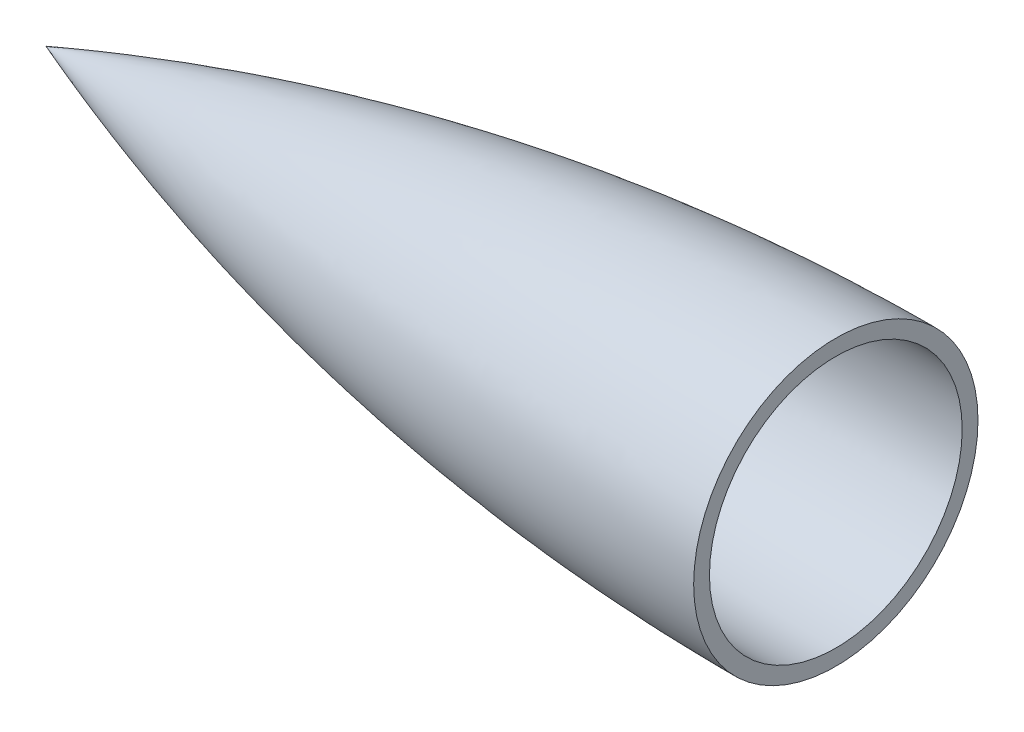
ISO-10303-21;
HEADER;
FILE_DESCRIPTION(('STEP AP214'),'2;1');
FILE_NAME('part.step','',(''),(''),'','','');
FILE_SCHEMA(('AUTOMOTIVE_DESIGN { 1 0 10303 214 1 1 1 1 }'));
ENDSEC;
DATA;
#1=APPLICATION_CONTEXT('core data for automotive mechanical design processes');
#2=APPLICATION_PROTOCOL_DEFINITION('international standard','automotive_design',2000,#1);
#3=PRODUCT_CONTEXT('',#1,'mechanical');
#4=PRODUCT('Part','Part','',(#3));
#5=PRODUCT_RELATED_PRODUCT_CATEGORY('part','',(#4));
#6=PRODUCT_DEFINITION_FORMATION('','',#4);
#7=PRODUCT_DEFINITION_CONTEXT('part definition',#1,'design');
#8=PRODUCT_DEFINITION('design','',#6,#7);
#9=PRODUCT_DEFINITION_SHAPE('','',#8);
#10=(LENGTH_UNIT() NAMED_UNIT(*) SI_UNIT(.MILLI.,.METRE.));
#11=(NAMED_UNIT(*) PLANE_ANGLE_UNIT() SI_UNIT($,.RADIAN.));
#12=(NAMED_UNIT(*) SI_UNIT($,.STERADIAN.) SOLID_ANGLE_UNIT());
#13=UNCERTAINTY_MEASURE_WITH_UNIT(LENGTH_MEASURE(1.E-05),#10,'distance_accuracy_value','');
#14=(GEOMETRIC_REPRESENTATION_CONTEXT(3) GLOBAL_UNCERTAINTY_ASSIGNED_CONTEXT((#13)) GLOBAL_UNIT_ASSIGNED_CONTEXT((#10,
#11,#12)) REPRESENTATION_CONTEXT('',''));
#15=CARTESIAN_POINT('',(0.,0.,0.));
#16=DIRECTION('',(0.,0.,1.));
#17=DIRECTION('',(1.,0.,0.));
#18=AXIS2_PLACEMENT_3D('',#15,#16,#17);
#19=CARTESIAN_POINT('',(250.000000001601,0.,-45.));
#20=CARTESIAN_POINT('',(249.682753819303,0.,-45.000000000001));
#21=CARTESIAN_POINT('',(249.047165821142,0.,-44.9994628827992));
#22=CARTESIAN_POINT('',(247.617281122081,0.,-44.9970458553814));
#23=CARTESIAN_POINT('',(246.231731715728,0.,-44.9906004634236));
#24=CARTESIAN_POINT('',(244.670319451456,0.,-44.9809324117025));
#25=CARTESIAN_POINT('',(243.163095115999,0.,-44.9680417436784));
#26=CARTESIAN_POINT('',(241.638882415672,0.,-44.9519285172921));
#27=CARTESIAN_POINT('',(240.120479762347,0.,-44.932592804978));
#28=CARTESIAN_POINT('',(238.220058241684,0.,-44.9043951660734));
#29=CARTESIAN_POINT('',(235.940682167867,0.,-44.864113404556));
#30=CARTESIAN_POINT('',(233.281021873147,0.,-44.807720155617));
#31=CARTESIAN_POINT('',(230.242044265543,0.,-44.7303833927708));
#32=CARTESIAN_POINT('',(227.20324496479,0.,-44.6401606837516));
#33=CARTESIAN_POINT('',(224.164957447808,0.,-44.5370536504946));
#34=CARTESIAN_POINT('',(221.127073954689,0.,-44.4210641462195));
#35=CARTESIAN_POINT('',(218.089745776704,0.,-44.2921942563917));
#36=CARTESIAN_POINT('',(215.052969657774,0.,-44.1504462992027));
#37=CARTESIAN_POINT('',(212.016834853689,0.,-43.9958228245218));
#38=CARTESIAN_POINT('',(208.981375405902,0.,-43.8283266109628));
#39=CARTESIAN_POINT('',(205.946657751534,0.,-43.6479606730414));
#40=CARTESIAN_POINT('',(202.154248213683,0.,-43.4064201459423));
#41=CARTESIAN_POINT('',(197.605051490867,0.,-43.0908455028409));
#42=CARTESIAN_POINT('',(192.300362370409,0.,-42.6851741792301));
#43=CARTESIAN_POINT('',(186.24201083089,0.,-42.1701533625944));
#44=CARTESIAN_POINT('',(180.188244336868,0.,-41.6037730978271));
#45=CARTESIAN_POINT('',(174.139498814474,0.,-40.9860741586634));
#46=CARTESIAN_POINT('',(166.585386817079,0.,-40.1498576349434));
#47=CARTESIAN_POINT('',(157.532234031388,0.,-39.0439456198505));
#48=CARTESIAN_POINT('',(148.495435574017,0.,-37.810162361996));
#49=CARTESIAN_POINT('',(139.477158719865,0.,-36.4488039435302));
#50=CARTESIAN_POINT('',(130.474994537663,0.,-34.985584453941));
#51=CARTESIAN_POINT('',(121.489808607384,0.,-33.4206449815079));
#52=CARTESIAN_POINT('',(112.527457587515,0.,-31.7288308559079));
#53=CARTESIAN_POINT('',(103.590096004027,0.,-29.9105498752083));
#54=CARTESIAN_POINT('',(96.1600172806627,0.,-28.3112226601881));
#55=CARTESIAN_POINT('',(90.2270253225319,0.,-26.9814008669732));
#56=CARTESIAN_POINT('',(82.8251339202143,0.,-25.2562839764021));
#57=CARTESIAN_POINT('',(73.9667295019805,0.,-23.085819843032));
#58=CARTESIAN_POINT('',(65.1396594601575,0.,-20.7903028519481));
#59=CARTESIAN_POINT('',(56.3461697320049,0.,-18.3703316152346));
#60=CARTESIAN_POINT('',(49.0415449608774,0.,-16.2709542187977));
#61=CARTESIAN_POINT('',(43.2124702427797,0.,-14.5420196195187));
#62=CARTESIAN_POINT('',(37.3979229210091,0.,-12.7635842736563));
#63=CARTESIAN_POINT('',(31.5992982435684,0.,-10.9361396269452));
#64=CARTESIAN_POINT('',(26.5382058407579,0.,-9.29376477167991));
#65=CARTESIAN_POINT('',(22.2118518676868,0.,-7.85601678704013));
#66=CARTESIAN_POINT('',(17.8907418367704,0.,-6.39272549032875));
#67=CARTESIAN_POINT('',(14.6616072499024,0.,-5.27898592233498));
#68=CARTESIAN_POINT('',(11.7854619936391,0.,-4.27079300681318));
#69=CARTESIAN_POINT('',(9.28953226291448,0.,-3.38429141929322));
#70=CARTESIAN_POINT('',(7.82992524395084,0.,-2.86186859651477));
#71=CARTESIAN_POINT('',(6.48097071990856,0.,-2.37717624226541));
#72=CARTESIAN_POINT('',(4.85947572254319,0.,-1.78764558499007));
#73=CARTESIAN_POINT('',(3.51779218985783,0.,-1.30136050625101));
#74=CARTESIAN_POINT('',(1.43519159810059,0.,-0.5322503252652));
#75=CARTESIAN_POINT('',(0.594667791723522,0.,-0.221248868355296));
#76=CARTESIAN_POINT('',(-8.35911975393574E-11,0.,3.11004655717512E-11));
#77=B_SPLINE_CURVE_WITH_KNOTS('',4,(#19,#20,#21,#22,#23,#24,#25,#26,#27,#28,#29,#30,#31,#32,#33,
#34,#35,#36,#37,#38,#39,#40,#41,#42,#43,#44,#45,#46,#47,#48,#49,#50,#51,#52,#53,#54,#55,#56,#57,
#58,#59,#60,#61,#62,#63,#64,#65,#66,#67,#68,#69,#70,#71,#72,#73,#74,#75,#76),.UNSPECIFIED.,.F.,
.F.,(5,1,1,1,1,1,1,1,1,1,1,1,1,1,1,1,1,1,1,1,1,1,1,1,1,1,1,1,1,1,1,1,1,1,1,1,1,1,1,1,1,1,1,1,1,
1,1,1,1,1,1,1,1,1,5),(0.0834130077958932,0.0883822961412844,0.0933515844866757,
0.0983208728320669,0.103290161177458,0.108259449522849,0.113228737868241,0.118198026213632,
0.123167314559023,0.13310589101726,0.143044467475496,0.152983043933732,0.162921620391969,
0.17286019724877,0.182798774105571,0.192737350962373,0.202675927819174,0.212614504519659,
0.222553081220144,0.23249165792063,0.242430234621115,0.262307387437352,0.282184540253589,
0.302061693760234,0.32193884726688,0.341816001873939,0.361693156480999,0.401447461179583,
0.44120176494361,0.461078919587591,0.480956074231572,0.520710380875337,0.560464681176746,
0.580341836465686,0.600218991754625,0.620096151034144,0.639973310313663,0.679727604095889,
0.719481905070318,0.739359062433057,0.759236219795796,0.779113374159564,0.798990528523332,
0.818867677687638,0.838744826851944,0.848683406381489,0.858621985911034,0.878499144970123,
0.883468435072133,0.888437725174143,0.893407015276152,0.898376305378162,0.903345595480171,
0.908314885582181,0.9182534657862),.UNSPECIFIED.);
#78=CARTESIAN_POINT('',(250.000000001601,0.,0.));
#79=DIRECTION('',(1.,0.,0.));
#80=AXIS1_PLACEMENT('',#78,#79);
#81=SURFACE_OF_REVOLUTION('',#77,#80);
#82=CARTESIAN_POINT('',(0.,0.,0.));
#83=VERTEX_POINT('',#82);
#84=VERTEX_LOOP('',#83);
#85=FACE_BOUND('',#84,.T.);
#86=CARTESIAN_POINT('',(250.000000001601,0.,0.));
#87=DIRECTION('',(1.,0.,0.));
#88=DIRECTION('',(0.,0.,-1.));
#89=AXIS2_PLACEMENT_3D('',#86,#87,#88);
#90=CIRCLE('',#89,44.9999999867158);
#91=CARTESIAN_POINT('',(250.000000001601,0.,-44.9999999867158));
#92=VERTEX_POINT('',#91);
#93=EDGE_CURVE('E11',#92,#92,#90,.T.);
#94=ORIENTED_EDGE('',*,*,#93,.F.);
#95=EDGE_LOOP('',(#94));
#96=FACE_BOUND('',#95,.T.);
#97=ADVANCED_FACE('F35',(#85,#96),#81,.F.);
#98=CARTESIAN_POINT('',(250.000000001601,0.,-44.9999999867158));
#99=DIRECTION('',(1.,0.,0.));
#100=DIRECTION('',(0.,0.,-1.));
#101=AXIS2_PLACEMENT_3D('',#98,#99,#100);
#102=PLANE('',#101);
#103=CARTESIAN_POINT('',(250.0000000016,0.,0.));
#104=DIRECTION('',(1.,0.,0.));
#105=DIRECTION('',(0.,0.,-1.));
#106=AXIS2_PLACEMENT_3D('',#103,#104,#105);
#107=CIRCLE('',#106,40.);
#108=CARTESIAN_POINT('',(250.0000000016,0.,-40.));
#109=VERTEX_POINT('',#108);
#110=EDGE_CURVE('E42',#109,#109,#107,.T.);
#111=ORIENTED_EDGE('',*,*,#110,.F.);
#112=EDGE_LOOP('',(#111));
#113=FACE_BOUND('',#112,.T.);
#114=ORIENTED_EDGE('',*,*,#93,.T.);
#115=EDGE_LOOP('',(#114));
#116=FACE_BOUND('',#115,.T.);
#117=ADVANCED_FACE('F51',(#113,#116),#102,.T.);
#118=CARTESIAN_POINT('',(250.000000001601,0.,-45.));
#119=CARTESIAN_POINT('',(249.682753819303,0.,-45.000000000001));
#120=CARTESIAN_POINT('',(249.047165821142,0.,-44.9994628827992));
#121=CARTESIAN_POINT('',(247.617281122081,0.,-44.9970458553814));
#122=CARTESIAN_POINT('',(246.231731715728,0.,-44.9906004634236));
#123=CARTESIAN_POINT('',(244.670319451456,0.,-44.9809324117025));
#124=CARTESIAN_POINT('',(243.163095115999,0.,-44.9680417436784));
#125=CARTESIAN_POINT('',(241.638882415672,0.,-44.9519285172921));
#126=CARTESIAN_POINT('',(240.120479762347,0.,-44.932592804978));
#127=CARTESIAN_POINT('',(238.220058241684,0.,-44.9043951660734));
#128=CARTESIAN_POINT('',(235.940682167867,0.,-44.864113404556));
#129=CARTESIAN_POINT('',(233.281021873147,0.,-44.807720155617));
#130=CARTESIAN_POINT('',(230.242044265543,0.,-44.7303833927708));
#131=CARTESIAN_POINT('',(227.20324496479,0.,-44.6401606837516));
#132=CARTESIAN_POINT('',(224.164957447808,0.,-44.5370536504946));
#133=CARTESIAN_POINT('',(221.127073954689,0.,-44.4210641462195));
#134=CARTESIAN_POINT('',(218.089745776704,0.,-44.2921942563917));
#135=CARTESIAN_POINT('',(215.052969657774,0.,-44.1504462992027));
#136=CARTESIAN_POINT('',(212.016834853689,0.,-43.9958228245218));
#137=CARTESIAN_POINT('',(208.981375405902,0.,-43.8283266109628));
#138=CARTESIAN_POINT('',(205.946657751534,0.,-43.6479606730414));
#139=CARTESIAN_POINT('',(202.154248213683,0.,-43.4064201459423));
#140=CARTESIAN_POINT('',(197.605051490867,0.,-43.0908455028409));
#141=CARTESIAN_POINT('',(192.300362370409,0.,-42.6851741792301));
#142=CARTESIAN_POINT('',(186.24201083089,0.,-42.1701533625944));
#143=CARTESIAN_POINT('',(180.188244336868,0.,-41.6037730978271));
#144=CARTESIAN_POINT('',(174.139498814474,0.,-40.9860741586634));
#145=CARTESIAN_POINT('',(166.585386817079,0.,-40.1498576349434));
#146=CARTESIAN_POINT('',(157.532234031388,0.,-39.0439456198505));
#147=CARTESIAN_POINT('',(148.495435574017,0.,-37.810162361996));
#148=CARTESIAN_POINT('',(139.477158719865,0.,-36.4488039435302));
#149=CARTESIAN_POINT('',(130.474994537663,0.,-34.985584453941));
#150=CARTESIAN_POINT('',(121.489808607384,0.,-33.4206449815079));
#151=CARTESIAN_POINT('',(112.527457587515,0.,-31.7288308559079));
#152=CARTESIAN_POINT('',(103.590096004027,0.,-29.9105498752083));
#153=CARTESIAN_POINT('',(96.1600172806627,0.,-28.3112226601881));
#154=CARTESIAN_POINT('',(90.2270253225319,0.,-26.9814008669732));
#155=CARTESIAN_POINT('',(82.8251339202143,0.,-25.2562839764021));
#156=CARTESIAN_POINT('',(73.9667295019805,0.,-23.085819843032));
#157=CARTESIAN_POINT('',(65.1396594601575,0.,-20.7903028519481));
#158=CARTESIAN_POINT('',(56.3461697320049,0.,-18.3703316152346));
#159=CARTESIAN_POINT('',(49.0415449608774,0.,-16.2709542187977));
#160=CARTESIAN_POINT('',(43.2124702427797,0.,-14.5420196195187));
#161=CARTESIAN_POINT('',(37.3979229210091,0.,-12.7635842736563));
#162=CARTESIAN_POINT('',(31.5992982435684,0.,-10.9361396269452));
#163=CARTESIAN_POINT('',(26.5382058407579,0.,-9.29376477167991));
#164=CARTESIAN_POINT('',(22.2118518676868,0.,-7.85601678704013));
#165=CARTESIAN_POINT('',(18.3021027580619,0.,-6.5320278574581));
#166=CARTESIAN_POINT('',(15.8403640897156,0.,-5.68517514169396));
#167=CARTESIAN_POINT('',(14.095332308379,0.,-5.07807901970256));
#168=CARTESIAN_POINT('',(13.0700322866476,0.,-4.71906836031014));
#169=B_SPLINE_CURVE_WITH_KNOTS('',4,(#118,#119,#120,#121,#122,#123,#124,#125,#126,#127,#128,
#129,#130,#131,#132,#133,#134,#135,#136,#137,#138,#139,#140,#141,#142,#143,#144,#145,#146,#147,
#148,#149,#150,#151,#152,#153,#154,#155,#156,#157,#158,#159,#160,#161,#162,#163,#164,#165,#166,
#167,#168),.UNSPECIFIED.,.F.,.F.,(5,1,1,1,1,1,1,1,1,1,1,1,1,1,1,1,1,1,1,1,1,1,1,1,1,1,1,1,1,1,1,
1,1,1,1,1,1,1,1,1,1,1,1,1,1,1,1,5),(0.0834130077958932,0.0883822961412844,0.0933515844866757,
0.0983208728320669,0.103290161177458,0.108259449522849,0.113228737868241,0.118198026213632,
0.123167314559023,0.13310589101726,0.143044467475496,0.152983043933732,0.162921620391969,
0.17286019724877,0.182798774105571,0.192737350962373,0.202675927819174,0.212614504519659,
0.222553081220144,0.23249165792063,0.242430234621115,0.262307387437352,0.282184540253589,
0.302061693760234,0.32193884726688,0.341816001873939,0.361693156480999,0.401447461179583,
0.44120176494361,0.461078919587591,0.480956074231572,0.520710380875337,0.560464681176746,
0.580341836465686,0.600218991754625,0.620096151034144,0.639973310313663,0.679727604095889,
0.719481905070318,0.739359062433057,0.759236219795796,0.779113374159564,0.798990528523332,
0.818867677687638,0.838744826851944,0.848683406381489,0.858621985911034,0.872822350085526),.UNSPECIFIED.);
#170=CARTESIAN_POINT('',(250.000000001601,0.,0.));
#171=DIRECTION('',(1.,0.,0.));
#172=AXIS1_PLACEMENT('',#170,#171);
#173=SURFACE_OF_REVOLUTION('',#169,#172);
#174=OFFSET_SURFACE('',#173,5.,.F.);
#175=CARTESIAN_POINT('',(14.7224226190812,0.,0.));
#176=VERTEX_POINT('',#175);
#177=VERTEX_LOOP('',#176);
#178=FACE_BOUND('',#177,.T.);
#179=ORIENTED_EDGE('',*,*,#110,.T.);
#180=EDGE_LOOP('',(#179));
#181=FACE_BOUND('',#180,.T.);
#182=ADVANCED_FACE('F48',(#178,#181),#174,.T.);
#183=CLOSED_SHELL('',(#97,#117,#182));
#184=MANIFOLD_SOLID_BREP('B2',#183);
#185=ADVANCED_BREP_SHAPE_REPRESENTATION('',(#18,#184),#14);
#186=SHAPE_DEFINITION_REPRESENTATION(#9,#185);
ENDSEC;
END-ISO-10303-21;
